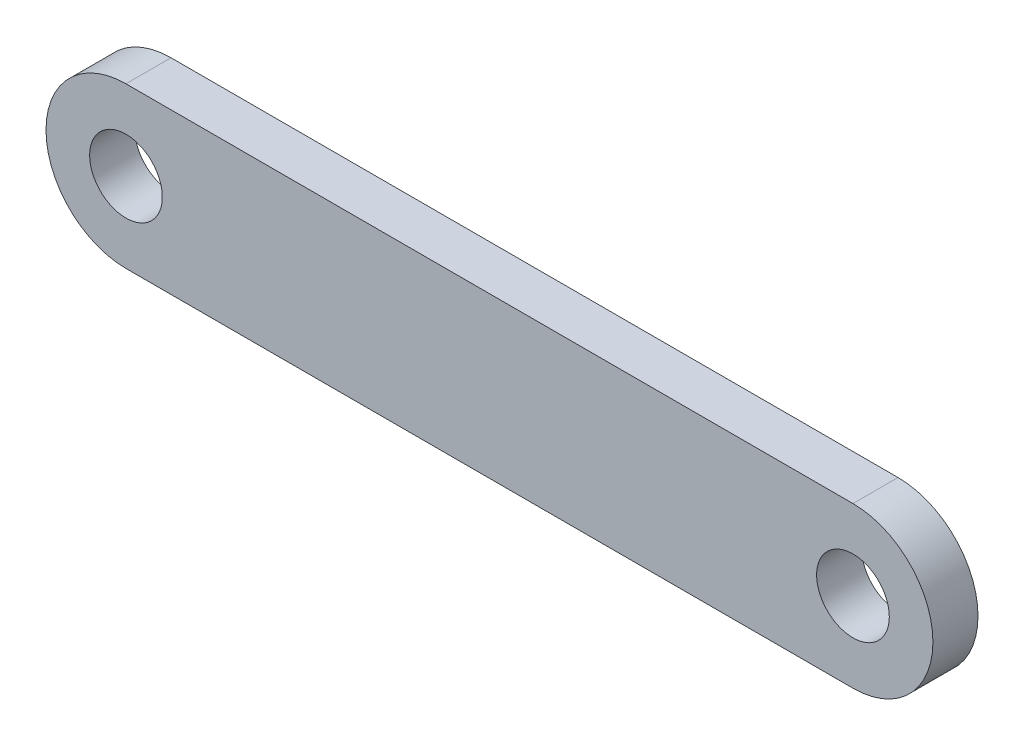
ISO-10303-21;
HEADER;
FILE_DESCRIPTION(('STEP AP214'),'2;1');
FILE_NAME('part.step','',(''),(''),'','','');
FILE_SCHEMA(('AUTOMOTIVE_DESIGN { 1 0 10303 214 1 1 1 1 }'));
ENDSEC;
DATA;
#1=APPLICATION_CONTEXT('core data for automotive mechanical design processes');
#2=APPLICATION_PROTOCOL_DEFINITION('international standard','automotive_design',2000,#1);
#3=PRODUCT_CONTEXT('',#1,'mechanical');
#4=PRODUCT('Part','Part','',(#3));
#5=PRODUCT_RELATED_PRODUCT_CATEGORY('part','',(#4));
#6=PRODUCT_DEFINITION_FORMATION('','',#4);
#7=PRODUCT_DEFINITION_CONTEXT('part definition',#1,'design');
#8=PRODUCT_DEFINITION('design','',#6,#7);
#9=PRODUCT_DEFINITION_SHAPE('','',#8);
#10=(LENGTH_UNIT() NAMED_UNIT(*) SI_UNIT(.MILLI.,.METRE.));
#11=(NAMED_UNIT(*) PLANE_ANGLE_UNIT() SI_UNIT($,.RADIAN.));
#12=(NAMED_UNIT(*) SI_UNIT($,.STERADIAN.) SOLID_ANGLE_UNIT());
#13=UNCERTAINTY_MEASURE_WITH_UNIT(LENGTH_MEASURE(1.E-05),#10,'distance_accuracy_value','');
#14=(GEOMETRIC_REPRESENTATION_CONTEXT(3) GLOBAL_UNCERTAINTY_ASSIGNED_CONTEXT((#13)) GLOBAL_UNIT_ASSIGNED_CONTEXT((#10,
#11,#12)) REPRESENTATION_CONTEXT('',''));
#15=CARTESIAN_POINT('',(0.,0.,0.));
#16=DIRECTION('',(0.,0.,1.));
#17=DIRECTION('',(1.,0.,0.));
#18=AXIS2_PLACEMENT_3D('',#15,#16,#17);
#19=CARTESIAN_POINT('',(25.,-0.47282608695652,3.1));
#20=DIRECTION('',(0.,0.,-1.));
#21=DIRECTION('',(-1.,0.,0.));
#22=AXIS2_PLACEMENT_3D('',#19,#20,#21);
#23=PLANE('',#22);
#24=CARTESIAN_POINT('',(25.,-0.47282608695652,3.1));
#25=DIRECTION('',(0.,0.,1.));
#26=DIRECTION('',(1.,0.,0.));
#27=AXIS2_PLACEMENT_3D('',#24,#25,#26);
#28=CIRCLE('',#27,2.5);
#29=CARTESIAN_POINT('',(27.5,-0.47282608695652,3.1));
#30=VERTEX_POINT('',#29);
#31=EDGE_CURVE('E99',#30,#30,#28,.T.);
#32=ORIENTED_EDGE('',*,*,#31,.F.);
#33=EDGE_LOOP('',(#32));
#34=FACE_BOUND('',#33,.T.);
#35=CARTESIAN_POINT('',(25.,-0.47282608695652,3.1));
#36=DIRECTION('',(0.,0.,1.));
#37=DIRECTION('',(-1.,0.,0.));
#38=AXIS2_PLACEMENT_3D('',#35,#36,#37);
#39=CIRCLE('',#38,5.5);
#40=CARTESIAN_POINT('',(25.,-5.97282608695652,3.1));
#41=VERTEX_POINT('',#40);
#42=CARTESIAN_POINT('',(25.,5.02717391304348,3.1));
#43=VERTEX_POINT('',#42);
#44=EDGE_CURVE('E84',#41,#43,#39,.T.);
#45=ORIENTED_EDGE('',*,*,#44,.T.);
#46=DIRECTION('',(-1.,0.,0.));
#47=VECTOR('',#46,1.);
#48=CARTESIAN_POINT('',(-25.,5.02717391304348,3.1));
#49=LINE('',#48,#47);
#50=CARTESIAN_POINT('',(-25.,5.02717391304348,3.1));
#51=VERTEX_POINT('',#50);
#52=EDGE_CURVE('E79',#43,#51,#49,.T.);
#53=ORIENTED_EDGE('',*,*,#52,.T.);
#54=CARTESIAN_POINT('',(-25.,-0.47282608695652,3.1));
#55=DIRECTION('',(0.,0.,1.));
#56=DIRECTION('',(1.,0.,0.));
#57=AXIS2_PLACEMENT_3D('',#54,#55,#56);
#58=CIRCLE('',#57,5.5);
#59=CARTESIAN_POINT('',(-25.,-5.97282608695652,3.1));
#60=VERTEX_POINT('',#59);
#61=EDGE_CURVE('E82',#51,#60,#58,.T.);
#62=ORIENTED_EDGE('',*,*,#61,.T.);
#63=DIRECTION('',(1.,0.,0.));
#64=VECTOR('',#63,1.);
#65=CARTESIAN_POINT('',(-25.,-5.97282608695652,3.1));
#66=LINE('',#65,#64);
#67=EDGE_CURVE('E49',#60,#41,#66,.T.);
#68=ORIENTED_EDGE('',*,*,#67,.T.);
#69=EDGE_LOOP('',(#45,#53,#62,#68));
#70=FACE_BOUND('',#69,.T.);
#71=CARTESIAN_POINT('',(-25.,-0.47282608695652,3.1));
#72=DIRECTION('',(0.,0.,1.));
#73=DIRECTION('',(-1.,0.,0.));
#74=AXIS2_PLACEMENT_3D('',#71,#72,#73);
#75=CIRCLE('',#74,2.5);
#76=CARTESIAN_POINT('',(-27.5,-0.47282608695652,3.1));
#77=VERTEX_POINT('',#76);
#78=EDGE_CURVE('E114',#77,#77,#75,.T.);
#79=ORIENTED_EDGE('',*,*,#78,.F.);
#80=EDGE_LOOP('',(#79));
#81=FACE_BOUND('',#80,.T.);
#82=ADVANCED_FACE('F32',(#34,#70,#81),#23,.F.);
#83=CARTESIAN_POINT('',(25.,-0.47282608695652,0.));
#84=DIRECTION('',(0.,0.,-1.));
#85=DIRECTION('',(-1.,0.,0.));
#86=AXIS2_PLACEMENT_3D('',#83,#84,#85);
#87=PLANE('',#86);
#88=CARTESIAN_POINT('',(25.,-0.47282608695652,0.));
#89=DIRECTION('',(0.,0.,1.));
#90=DIRECTION('',(1.,0.,0.));
#91=AXIS2_PLACEMENT_3D('',#88,#89,#90);
#92=CIRCLE('',#91,2.5);
#93=CARTESIAN_POINT('',(27.5,-0.47282608695652,0.));
#94=VERTEX_POINT('',#93);
#95=EDGE_CURVE('E111',#94,#94,#92,.T.);
#96=ORIENTED_EDGE('',*,*,#95,.T.);
#97=EDGE_LOOP('',(#96));
#98=FACE_BOUND('',#97,.T.);
#99=CARTESIAN_POINT('',(25.,-0.47282608695652,0.));
#100=DIRECTION('',(0.,0.,1.));
#101=DIRECTION('',(-1.,0.,0.));
#102=AXIS2_PLACEMENT_3D('',#99,#100,#101);
#103=CIRCLE('',#102,5.5);
#104=CARTESIAN_POINT('',(25.,-5.97282608695652,0.));
#105=VERTEX_POINT('',#104);
#106=CARTESIAN_POINT('',(25.,5.02717391304348,0.));
#107=VERTEX_POINT('',#106);
#108=EDGE_CURVE('E96',#105,#107,#103,.T.);
#109=ORIENTED_EDGE('',*,*,#108,.F.);
#110=DIRECTION('',(1.,0.,0.));
#111=VECTOR('',#110,1.);
#112=CARTESIAN_POINT('',(-25.,-5.97282608695652,0.));
#113=LINE('',#112,#111);
#114=CARTESIAN_POINT('',(-25.,-5.97282608695652,0.));
#115=VERTEX_POINT('',#114);
#116=EDGE_CURVE('E72',#115,#105,#113,.T.);
#117=ORIENTED_EDGE('',*,*,#116,.F.);
#118=CARTESIAN_POINT('',(-25.,-0.47282608695652,0.));
#119=DIRECTION('',(0.,0.,1.));
#120=DIRECTION('',(1.,0.,0.));
#121=AXIS2_PLACEMENT_3D('',#118,#119,#120);
#122=CIRCLE('',#121,5.5);
#123=CARTESIAN_POINT('',(-25.,5.02717391304348,0.));
#124=VERTEX_POINT('',#123);
#125=EDGE_CURVE('E66',#124,#115,#122,.T.);
#126=ORIENTED_EDGE('',*,*,#125,.F.);
#127=DIRECTION('',(-1.,0.,0.));
#128=VECTOR('',#127,1.);
#129=CARTESIAN_POINT('',(-25.,5.02717391304348,0.));
#130=LINE('',#129,#128);
#131=EDGE_CURVE('E88',#107,#124,#130,.T.);
#132=ORIENTED_EDGE('',*,*,#131,.F.);
#133=EDGE_LOOP('',(#109,#117,#126,#132));
#134=FACE_BOUND('',#133,.T.);
#135=CARTESIAN_POINT('',(-25.,-0.47282608695652,0.));
#136=DIRECTION('',(0.,0.,1.));
#137=DIRECTION('',(-1.,0.,0.));
#138=AXIS2_PLACEMENT_3D('',#135,#136,#137);
#139=CIRCLE('',#138,2.5);
#140=CARTESIAN_POINT('',(-27.5,-0.47282608695652,0.));
#141=VERTEX_POINT('',#140);
#142=EDGE_CURVE('E117',#141,#141,#139,.T.);
#143=ORIENTED_EDGE('',*,*,#142,.T.);
#144=EDGE_LOOP('',(#143));
#145=FACE_BOUND('',#144,.T.);
#146=ADVANCED_FACE('F107',(#98,#134,#145),#87,.T.);
#147=CARTESIAN_POINT('',(25.,-0.47282608695652,3.1));
#148=DIRECTION('',(0.,0.,-1.));
#149=DIRECTION('',(-1.,0.,0.));
#150=AXIS2_PLACEMENT_3D('',#147,#148,#149);
#151=CYLINDRICAL_SURFACE('',#150,5.5);
#152=ORIENTED_EDGE('',*,*,#108,.T.);
#153=DIRECTION('',(0.,0.,-1.));
#154=VECTOR('',#153,1.);
#155=CARTESIAN_POINT('',(25.,5.02717391304348,3.1));
#156=LINE('',#155,#154);
#157=EDGE_CURVE('E11',#43,#107,#156,.T.);
#158=ORIENTED_EDGE('',*,*,#157,.F.);
#159=ORIENTED_EDGE('',*,*,#44,.F.);
#160=DIRECTION('',(0.,0.,-1.));
#161=VECTOR('',#160,1.);
#162=CARTESIAN_POINT('',(25.,-5.97282608695652,3.1));
#163=LINE('',#162,#161);
#164=EDGE_CURVE('E92',#41,#105,#163,.T.);
#165=ORIENTED_EDGE('',*,*,#164,.T.);
#166=EDGE_LOOP('',(#152,#158,#159,#165));
#167=FACE_BOUND('',#166,.T.);
#168=ADVANCED_FACE('F34',(#167),#151,.T.);
#169=CARTESIAN_POINT('',(-25.,5.02717391304348,3.1));
#170=DIRECTION('',(0.,-1.,0.));
#171=DIRECTION('',(0.,0.,-1.));
#172=AXIS2_PLACEMENT_3D('',#169,#170,#171);
#173=PLANE('',#172);
#174=ORIENTED_EDGE('',*,*,#131,.T.);
#175=DIRECTION('',(0.,0.,-1.));
#176=VECTOR('',#175,1.);
#177=CARTESIAN_POINT('',(-25.,5.02717391304348,3.1));
#178=LINE('',#177,#176);
#179=EDGE_CURVE('E41',#51,#124,#178,.T.);
#180=ORIENTED_EDGE('',*,*,#179,.F.);
#181=ORIENTED_EDGE('',*,*,#52,.F.);
#182=ORIENTED_EDGE('',*,*,#157,.T.);
#183=EDGE_LOOP('',(#174,#180,#181,#182));
#184=FACE_BOUND('',#183,.T.);
#185=ADVANCED_FACE('F87',(#184),#173,.F.);
#186=CARTESIAN_POINT('',(-25.,-0.47282608695652,3.1));
#187=DIRECTION('',(0.,0.,-1.));
#188=DIRECTION('',(-1.,0.,0.));
#189=AXIS2_PLACEMENT_3D('',#186,#187,#188);
#190=CYLINDRICAL_SURFACE('',#189,5.5);
#191=ORIENTED_EDGE('',*,*,#125,.T.);
#192=DIRECTION('',(0.,0.,-1.));
#193=VECTOR('',#192,1.);
#194=CARTESIAN_POINT('',(-25.,-5.97282608695652,3.1));
#195=LINE('',#194,#193);
#196=EDGE_CURVE('E89',#60,#115,#195,.T.);
#197=ORIENTED_EDGE('',*,*,#196,.F.);
#198=ORIENTED_EDGE('',*,*,#61,.F.);
#199=ORIENTED_EDGE('',*,*,#179,.T.);
#200=EDGE_LOOP('',(#191,#197,#198,#199));
#201=FACE_BOUND('',#200,.T.);
#202=ADVANCED_FACE('F90',(#201),#190,.T.);
#203=CARTESIAN_POINT('',(-25.,-5.97282608695652,3.1));
#204=DIRECTION('',(0.,1.,0.));
#205=DIRECTION('',(0.,0.,1.));
#206=AXIS2_PLACEMENT_3D('',#203,#204,#205);
#207=PLANE('',#206);
#208=ORIENTED_EDGE('',*,*,#116,.T.);
#209=ORIENTED_EDGE('',*,*,#164,.F.);
#210=ORIENTED_EDGE('',*,*,#67,.F.);
#211=ORIENTED_EDGE('',*,*,#196,.T.);
#212=EDGE_LOOP('',(#208,#209,#210,#211));
#213=FACE_BOUND('',#212,.T.);
#214=ADVANCED_FACE('F104',(#213),#207,.F.);
#215=CARTESIAN_POINT('',(25.,-0.47282608695652,3.1));
#216=DIRECTION('',(0.,0.,-1.));
#217=DIRECTION('',(-1.,0.,0.));
#218=AXIS2_PLACEMENT_3D('',#215,#216,#217);
#219=CYLINDRICAL_SURFACE('',#218,2.5);
#220=ORIENTED_EDGE('',*,*,#31,.T.);
#221=EDGE_LOOP('',(#220));
#222=FACE_BOUND('',#221,.T.);
#223=ORIENTED_EDGE('',*,*,#95,.F.);
#224=EDGE_LOOP('',(#223));
#225=FACE_BOUND('',#224,.T.);
#226=ADVANCED_FACE('F135',(#222,#225),#219,.F.);
#227=CARTESIAN_POINT('',(-25.,-0.47282608695652,3.1));
#228=DIRECTION('',(0.,0.,-1.));
#229=DIRECTION('',(-1.,0.,0.));
#230=AXIS2_PLACEMENT_3D('',#227,#228,#229);
#231=CYLINDRICAL_SURFACE('',#230,2.5);
#232=ORIENTED_EDGE('',*,*,#78,.T.);
#233=EDGE_LOOP('',(#232));
#234=FACE_BOUND('',#233,.T.);
#235=ORIENTED_EDGE('',*,*,#142,.F.);
#236=EDGE_LOOP('',(#235));
#237=FACE_BOUND('',#236,.T.);
#238=ADVANCED_FACE('F123',(#234,#237),#231,.F.);
#239=CLOSED_SHELL('',(#82,#146,#168,#185,#202,#214,#226,#238));
#240=MANIFOLD_SOLID_BREP('B2',#239);
#241=ADVANCED_BREP_SHAPE_REPRESENTATION('',(#18,#240),#14);
#242=SHAPE_DEFINITION_REPRESENTATION(#9,#241);
ENDSEC;
END-ISO-10303-21;
